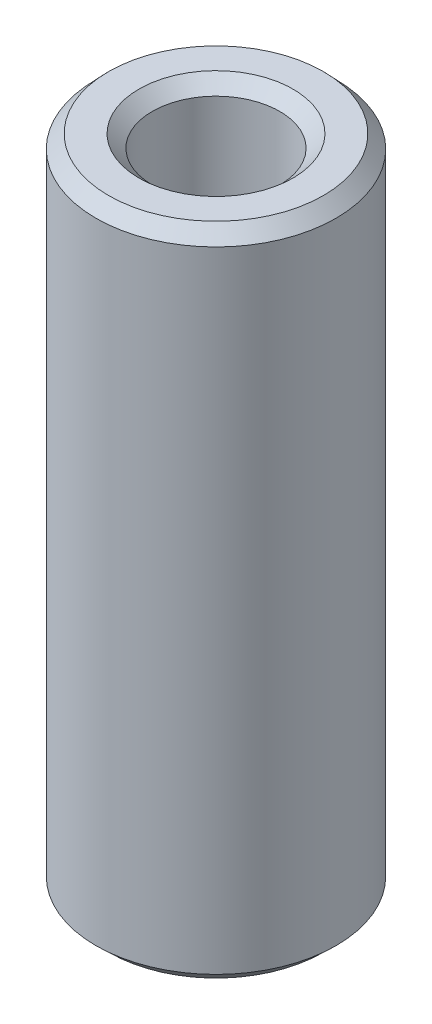
ISO-10303-21;
HEADER;
FILE_DESCRIPTION(('STEP AP214'),'2;1');
FILE_NAME('part.step','',(''),(''),'','','');
FILE_SCHEMA(('AUTOMOTIVE_DESIGN { 1 0 10303 214 1 1 1 1 }'));
ENDSEC;
DATA;
#1=APPLICATION_CONTEXT('core data for automotive mechanical design processes');
#2=APPLICATION_PROTOCOL_DEFINITION('international standard','automotive_design',2000,#1);
#3=PRODUCT_CONTEXT('',#1,'mechanical');
#4=PRODUCT('Part','Part','',(#3));
#5=PRODUCT_RELATED_PRODUCT_CATEGORY('part','',(#4));
#6=PRODUCT_DEFINITION_FORMATION('','',#4);
#7=PRODUCT_DEFINITION_CONTEXT('part definition',#1,'design');
#8=PRODUCT_DEFINITION('design','',#6,#7);
#9=PRODUCT_DEFINITION_SHAPE('','',#8);
#10=(LENGTH_UNIT() NAMED_UNIT(*) SI_UNIT(.MILLI.,.METRE.));
#11=(NAMED_UNIT(*) PLANE_ANGLE_UNIT() SI_UNIT($,.RADIAN.));
#12=(NAMED_UNIT(*) SI_UNIT($,.STERADIAN.) SOLID_ANGLE_UNIT());
#13=UNCERTAINTY_MEASURE_WITH_UNIT(LENGTH_MEASURE(1.E-05),#10,'distance_accuracy_value','');
#14=(GEOMETRIC_REPRESENTATION_CONTEXT(3) GLOBAL_UNCERTAINTY_ASSIGNED_CONTEXT((#13)) GLOBAL_UNIT_ASSIGNED_CONTEXT((#10,
#11,#12)) REPRESENTATION_CONTEXT('',''));
#15=CARTESIAN_POINT('',(0.,0.,0.));
#16=DIRECTION('',(0.,0.,1.));
#17=DIRECTION('',(1.,0.,0.));
#18=AXIS2_PLACEMENT_3D('',#15,#16,#17);
#19=CARTESIAN_POINT('',(0.,191.280801121969,0.));
#20=DIRECTION('',(0.,-1.,0.));
#21=DIRECTION('',(0.,0.,-1.));
#22=AXIS2_PLACEMENT_3D('',#19,#20,#21);
#23=CYLINDRICAL_SURFACE('',#22,35.);
#24=CARTESIAN_POINT('',(0.,3.68205303371244,0.));
#25=DIRECTION('',(0.,1.,0.));
#26=DIRECTION('',(0.,0.,1.));
#27=AXIS2_PLACEMENT_3D('',#24,#25,#26);
#28=CIRCLE('',#27,35.);
#29=CARTESIAN_POINT('',(0.,3.68205303371244,35.));
#30=VERTEX_POINT('',#29);
#31=EDGE_CURVE('E10',#30,#30,#28,.T.);
#32=ORIENTED_EDGE('',*,*,#31,.T.);
#33=EDGE_LOOP('',(#32));
#34=FACE_BOUND('',#33,.T.);
#35=CARTESIAN_POINT('',(0.,187.387167435956,0.));
#36=DIRECTION('',(0.,1.,0.));
#37=DIRECTION('',(0.,0.,1.));
#38=AXIS2_PLACEMENT_3D('',#35,#36,#37);
#39=CIRCLE('',#38,35.);
#40=CARTESIAN_POINT('',(0.,187.387167435956,35.));
#41=VERTEX_POINT('',#40);
#42=EDGE_CURVE('E50',#41,#41,#39,.F.);
#43=ORIENTED_EDGE('',*,*,#42,.T.);
#44=EDGE_LOOP('',(#43));
#45=FACE_BOUND('',#44,.T.);
#46=ADVANCED_FACE('F39',(#34,#45),#23,.T.);
#47=CARTESIAN_POINT('',(0.,191.280801121969,0.));
#48=DIRECTION('',(0.,1.,0.));
#49=DIRECTION('',(0.,0.,1.));
#50=AXIS2_PLACEMENT_3D('',#47,#48,#49);
#51=PLANE('',#50);
#52=CARTESIAN_POINT('',(0.,191.280801121969,0.));
#53=DIRECTION('',(0.,1.,0.));
#54=DIRECTION('',(0.,0.,1.));
#55=AXIS2_PLACEMENT_3D('',#52,#53,#54);
#56=CIRCLE('',#55,22.4750439168898);
#57=CARTESIAN_POINT('',(0.,191.280801121969,22.4750439168898));
#58=VERTEX_POINT('',#57);
#59=EDGE_CURVE('E58',#58,#58,#56,.F.);
#60=ORIENTED_EDGE('',*,*,#59,.T.);
#61=EDGE_LOOP('',(#60));
#62=FACE_BOUND('',#61,.T.);
#63=CARTESIAN_POINT('',(0.,191.280801121969,0.));
#64=DIRECTION('',(0.,1.,0.));
#65=DIRECTION('',(0.,0.,1.));
#66=AXIS2_PLACEMENT_3D('',#63,#64,#65);
#67=CIRCLE('',#66,31.3179469662876);
#68=CARTESIAN_POINT('',(0.,191.280801121969,31.3179469662876));
#69=VERTEX_POINT('',#68);
#70=EDGE_CURVE('E61',#69,#69,#67,.T.);
#71=ORIENTED_EDGE('',*,*,#70,.T.);
#72=EDGE_LOOP('',(#71));
#73=FACE_BOUND('',#72,.T.);
#74=ADVANCED_FACE('F88',(#62,#73),#51,.T.);
#75=CARTESIAN_POINT('',(0.,0.,0.));
#76=DIRECTION('',(0.,1.,0.));
#77=DIRECTION('',(0.,0.,1.));
#78=AXIS2_PLACEMENT_3D('',#75,#76,#77);
#79=PLANE('',#78);
#80=CARTESIAN_POINT('',(0.,0.,0.));
#81=DIRECTION('',(0.,1.,0.));
#82=DIRECTION('',(0.,0.,1.));
#83=AXIS2_PLACEMENT_3D('',#80,#81,#82);
#84=CIRCLE('',#83,22.2634632645902);
#85=CARTESIAN_POINT('',(0.,0.,22.2634632645902));
#86=VERTEX_POINT('',#85);
#87=EDGE_CURVE('E51',#86,#86,#84,.T.);
#88=ORIENTED_EDGE('',*,*,#87,.T.);
#89=EDGE_LOOP('',(#88));
#90=FACE_BOUND('',#89,.T.);
#91=CARTESIAN_POINT('',(0.,0.,0.));
#92=DIRECTION('',(0.,1.,0.));
#93=DIRECTION('',(0.,0.,1.));
#94=AXIS2_PLACEMENT_3D('',#91,#92,#93);
#95=CIRCLE('',#94,31.1063663139879);
#96=CARTESIAN_POINT('',(0.,0.,31.1063663139879));
#97=VERTEX_POINT('',#96);
#98=EDGE_CURVE('E54',#97,#97,#95,.F.);
#99=ORIENTED_EDGE('',*,*,#98,.T.);
#100=EDGE_LOOP('',(#99));
#101=FACE_BOUND('',#100,.T.);
#102=ADVANCED_FACE('F83',(#90,#101),#79,.F.);
#103=CARTESIAN_POINT('',(0.,191.280801121969,0.));
#104=DIRECTION('',(0.,-1.,0.));
#105=DIRECTION('',(0.,0.,-1.));
#106=AXIS2_PLACEMENT_3D('',#103,#104,#105);
#107=CYLINDRICAL_SURFACE('',#106,18.5814102308778);
#108=CARTESIAN_POINT('',(0.,187.598748088256,0.));
#109=DIRECTION('',(0.,1.,0.));
#110=DIRECTION('',(0.,0.,1.));
#111=AXIS2_PLACEMENT_3D('',#108,#109,#110);
#112=CIRCLE('',#111,18.5814102308778);
#113=CARTESIAN_POINT('',(0.,187.598748088256,18.5814102308778));
#114=VERTEX_POINT('',#113);
#115=EDGE_CURVE('E67',#114,#114,#112,.T.);
#116=ORIENTED_EDGE('',*,*,#115,.T.);
#117=EDGE_LOOP('',(#116));
#118=FACE_BOUND('',#117,.T.);
#119=CARTESIAN_POINT('',(0.,3.89363368601212,0.));
#120=DIRECTION('',(0.,1.,0.));
#121=DIRECTION('',(0.,0.,1.));
#122=AXIS2_PLACEMENT_3D('',#119,#120,#121);
#123=CIRCLE('',#122,18.5814102308778);
#124=CARTESIAN_POINT('',(0.,3.89363368601212,18.5814102308778));
#125=VERTEX_POINT('',#124);
#126=EDGE_CURVE('E69',#125,#125,#123,.F.);
#127=ORIENTED_EDGE('',*,*,#126,.T.);
#128=EDGE_LOOP('',(#127));
#129=FACE_BOUND('',#128,.T.);
#130=ADVANCED_FACE('F71',(#118,#129),#107,.F.);
#131=CARTESIAN_POINT('',(0.,187.598748088256,0.));
#132=DIRECTION('',(0.,1.,0.));
#133=DIRECTION('',(0.,0.,1.));
#134=AXIS2_PLACEMENT_3D('',#131,#132,#133);
#135=CONICAL_SURFACE('',#134,18.5814102308778,0.813319812378599);
#136=ORIENTED_EDGE('',*,*,#59,.F.);
#137=EDGE_LOOP('',(#136));
#138=FACE_BOUND('',#137,.T.);
#139=ORIENTED_EDGE('',*,*,#115,.F.);
#140=EDGE_LOOP('',(#139));
#141=FACE_BOUND('',#140,.T.);
#142=ADVANCED_FACE('F77',(#138,#141),#135,.F.);
#143=CARTESIAN_POINT('',(0.,0.,0.));
#144=DIRECTION('',(0.,-1.,0.));
#145=DIRECTION('',(0.,0.,-1.));
#146=AXIS2_PLACEMENT_3D('',#143,#144,#145);
#147=CONICAL_SURFACE('',#146,22.2634632645902,0.757476514416287);
#148=ORIENTED_EDGE('',*,*,#126,.F.);
#149=EDGE_LOOP('',(#148));
#150=FACE_BOUND('',#149,.T.);
#151=ORIENTED_EDGE('',*,*,#87,.F.);
#152=EDGE_LOOP('',(#151));
#153=FACE_BOUND('',#152,.T.);
#154=ADVANCED_FACE('F73',(#150,#153),#147,.F.);
#155=CARTESIAN_POINT('',(0.,3.68205303371244,0.));
#156=DIRECTION('',(0.,1.,0.));
#157=DIRECTION('',(0.,0.,1.));
#158=AXIS2_PLACEMENT_3D('',#155,#156,#157);
#159=CONICAL_SURFACE('',#158,35.,0.813319812378602);
#160=ORIENTED_EDGE('',*,*,#98,.F.);
#161=EDGE_LOOP('',(#160));
#162=FACE_BOUND('',#161,.T.);
#163=ORIENTED_EDGE('',*,*,#31,.F.);
#164=EDGE_LOOP('',(#163));
#165=FACE_BOUND('',#164,.T.);
#166=ADVANCED_FACE('F76',(#162,#165),#159,.T.);
#167=CARTESIAN_POINT('',(0.,191.280801121969,0.));
#168=DIRECTION('',(0.,-1.,0.));
#169=DIRECTION('',(0.,0.,-1.));
#170=AXIS2_PLACEMENT_3D('',#167,#168,#169);
#171=CONICAL_SURFACE('',#170,31.3179469662876,0.75747651441629);
#172=ORIENTED_EDGE('',*,*,#42,.F.);
#173=EDGE_LOOP('',(#172));
#174=FACE_BOUND('',#173,.T.);
#175=ORIENTED_EDGE('',*,*,#70,.F.);
#176=EDGE_LOOP('',(#175));
#177=FACE_BOUND('',#176,.T.);
#178=ADVANCED_FACE('F45',(#174,#177),#171,.T.);
#179=CLOSED_SHELL('',(#46,#74,#102,#130,#142,#154,#166,#178));
#180=MANIFOLD_SOLID_BREP('B2',#179);
#181=ADVANCED_BREP_SHAPE_REPRESENTATION('',(#18,#180),#14);
#182=SHAPE_DEFINITION_REPRESENTATION(#9,#181);
ENDSEC;
END-ISO-10303-21;
